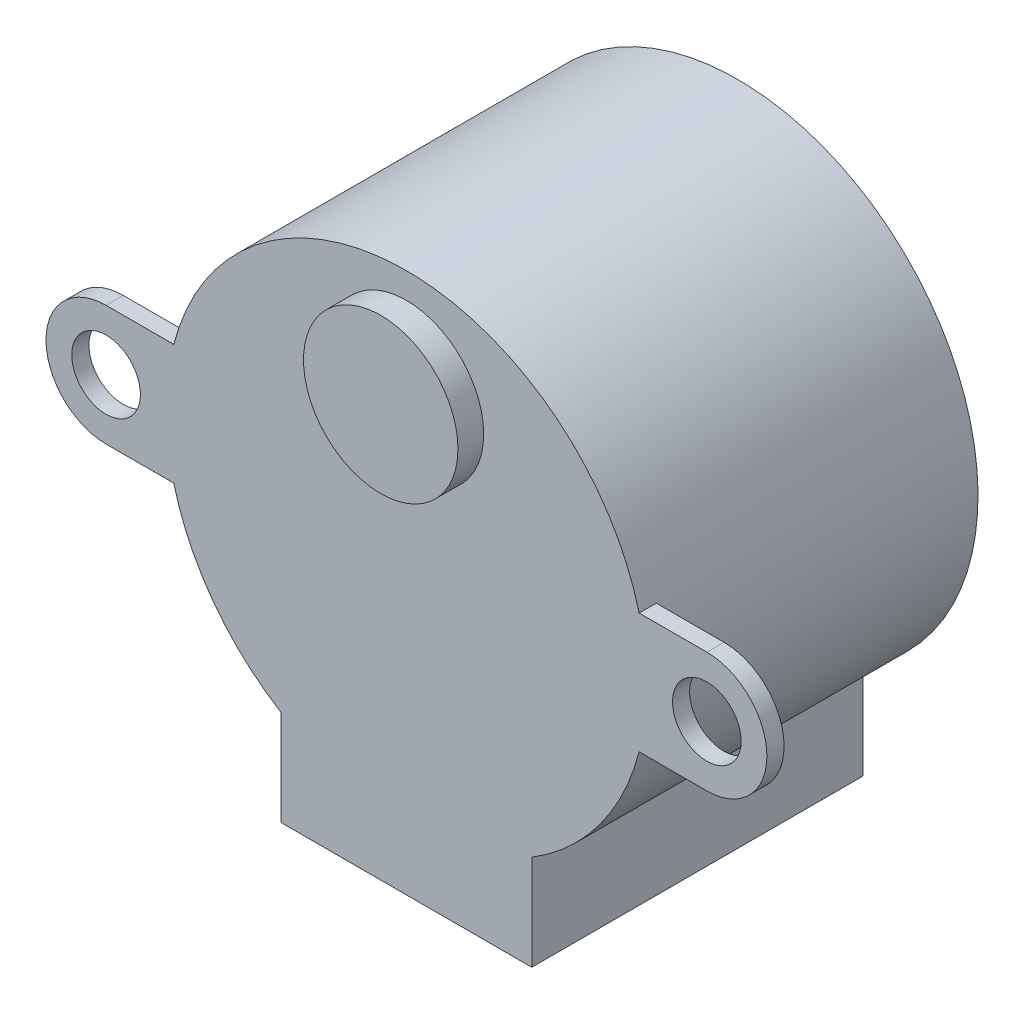
ISO-10303-21;
HEADER;
FILE_DESCRIPTION(('STEP AP214'),'2;1');
FILE_NAME('part.step','',(''),(''),'','','');
FILE_SCHEMA(('AUTOMOTIVE_DESIGN { 1 0 10303 214 1 1 1 1 }'));
ENDSEC;
DATA;
#1=APPLICATION_CONTEXT('core data for automotive mechanical design processes');
#2=APPLICATION_PROTOCOL_DEFINITION('international standard','automotive_design',2000,#1);
#3=PRODUCT_CONTEXT('',#1,'mechanical');
#4=PRODUCT('Part','Part','',(#3));
#5=PRODUCT_RELATED_PRODUCT_CATEGORY('part','',(#4));
#6=PRODUCT_DEFINITION_FORMATION('','',#4);
#7=PRODUCT_DEFINITION_CONTEXT('part definition',#1,'design');
#8=PRODUCT_DEFINITION('design','',#6,#7);
#9=PRODUCT_DEFINITION_SHAPE('','',#8);
#10=(LENGTH_UNIT() NAMED_UNIT(*) SI_UNIT(.MILLI.,.METRE.));
#11=(NAMED_UNIT(*) PLANE_ANGLE_UNIT() SI_UNIT($,.RADIAN.));
#12=(NAMED_UNIT(*) SI_UNIT($,.STERADIAN.) SOLID_ANGLE_UNIT());
#13=UNCERTAINTY_MEASURE_WITH_UNIT(LENGTH_MEASURE(1.E-05),#10,'distance_accuracy_value','');
#14=(GEOMETRIC_REPRESENTATION_CONTEXT(3) GLOBAL_UNCERTAINTY_ASSIGNED_CONTEXT((#13)) GLOBAL_UNIT_ASSIGNED_CONTEXT((#10,
#11,#12)) REPRESENTATION_CONTEXT('',''));
#15=CARTESIAN_POINT('',(0.,0.,0.));
#16=DIRECTION('',(0.,0.,1.));
#17=DIRECTION('',(1.,0.,0.));
#18=AXIS2_PLACEMENT_3D('',#15,#16,#17);
#19=CARTESIAN_POINT('',(-50.0234966452764,38.5025884499282,19.3));
#20=DIRECTION('',(0.,0.,-1.));
#21=DIRECTION('',(-1.,0.,0.));
#22=AXIS2_PLACEMENT_3D('',#19,#20,#21);
#23=CYLINDRICAL_SURFACE('',#22,14.);
#24=CARTESIAN_POINT('',(-50.0234966452764,38.5025884499282,0.));
#25=DIRECTION('',(0.,0.,1.));
#26=DIRECTION('',(1.,0.,0.));
#27=AXIS2_PLACEMENT_3D('',#24,#25,#26);
#28=CIRCLE('',#27,14.);
#29=CARTESIAN_POINT('',(-42.7234966452764,26.5564593697617,0.));
#30=VERTEX_POINT('',#29);
#31=CARTESIAN_POINT('',(-57.3234966452764,26.5564593697617,0.));
#32=VERTEX_POINT('',#31);
#33=EDGE_CURVE('E42',#30,#32,#28,.T.);
#34=ORIENTED_EDGE('',*,*,#33,.T.);
#35=DIRECTION('',(0.,0.,1.));
#36=VECTOR('',#35,1.);
#37=CARTESIAN_POINT('',(-57.3234966452764,26.5564593697617,18.3));
#38=LINE('',#37,#36);
#39=CARTESIAN_POINT('',(-57.3234966452764,26.5564593697617,19.3));
#40=VERTEX_POINT('',#39);
#41=EDGE_CURVE('E165',#32,#40,#38,.T.);
#42=ORIENTED_EDGE('',*,*,#41,.T.);
#43=CARTESIAN_POINT('',(-50.0234966452764,38.5025884499282,19.3));
#44=DIRECTION('',(0.,0.,1.));
#45=DIRECTION('',(1.,0.,0.));
#46=AXIS2_PLACEMENT_3D('',#43,#44,#45);
#47=CIRCLE('',#46,14.);
#48=CARTESIAN_POINT('',(-63.5789383570023,35.0025884499282,19.3));
#49=VERTEX_POINT('',#48);
#50=EDGE_CURVE('E11',#49,#40,#47,.T.);
#51=ORIENTED_EDGE('',*,*,#50,.F.);
#52=DIRECTION('',(0.,0.,1.));
#53=VECTOR('',#52,1.);
#54=CARTESIAN_POINT('',(-63.5789383570023,35.0025884499282,18.3));
#55=LINE('',#54,#53);
#56=CARTESIAN_POINT('',(-63.5789383570023,35.0025884499282,18.3));
#57=VERTEX_POINT('',#56);
#58=EDGE_CURVE('E231',#57,#49,#55,.T.);
#59=ORIENTED_EDGE('',*,*,#58,.F.);
#60=CARTESIAN_POINT('',(-50.0234966452764,38.5025884499282,18.3));
#61=DIRECTION('',(0.,0.,1.));
#62=DIRECTION('',(1.,0.,0.));
#63=AXIS2_PLACEMENT_3D('',#60,#61,#62);
#64=CIRCLE('',#63,14.);
#65=CARTESIAN_POINT('',(-63.5789383570023,42.0025884499282,18.3));
#66=VERTEX_POINT('',#65);
#67=EDGE_CURVE('E213',#66,#57,#64,.T.);
#68=ORIENTED_EDGE('',*,*,#67,.F.);
#69=DIRECTION('',(0.,0.,1.));
#70=VECTOR('',#69,1.);
#71=CARTESIAN_POINT('',(-63.5789383570023,42.0025884499282,18.3));
#72=LINE('',#71,#70);
#73=CARTESIAN_POINT('',(-63.5789383570023,42.0025884499282,19.3));
#74=VERTEX_POINT('',#73);
#75=EDGE_CURVE('E228',#66,#74,#72,.T.);
#76=ORIENTED_EDGE('',*,*,#75,.T.);
#77=CARTESIAN_POINT('',(-36.4680549335504,42.0025884499282,19.3));
#78=VERTEX_POINT('',#77);
#79=EDGE_CURVE('E48',#78,#74,#47,.T.);
#80=ORIENTED_EDGE('',*,*,#79,.F.);
#81=DIRECTION('',(0.,0.,1.));
#82=VECTOR('',#81,1.);
#83=CARTESIAN_POINT('',(-36.4680549335504,42.0025884499282,18.3));
#84=LINE('',#83,#82);
#85=CARTESIAN_POINT('',(-36.4680549335504,42.0025884499282,18.3));
#86=VERTEX_POINT('',#85);
#87=EDGE_CURVE('E63',#86,#78,#84,.T.);
#88=ORIENTED_EDGE('',*,*,#87,.F.);
#89=CARTESIAN_POINT('',(-50.0234966452764,38.5025884499282,18.3));
#90=DIRECTION('',(0.,0.,1.));
#91=DIRECTION('',(1.,0.,0.));
#92=AXIS2_PLACEMENT_3D('',#89,#90,#91);
#93=CIRCLE('',#92,14.);
#94=CARTESIAN_POINT('',(-36.4680549335504,35.0025884499282,18.3));
#95=VERTEX_POINT('',#94);
#96=EDGE_CURVE('E183',#95,#86,#93,.T.);
#97=ORIENTED_EDGE('',*,*,#96,.F.);
#98=DIRECTION('',(0.,0.,1.));
#99=VECTOR('',#98,1.);
#100=CARTESIAN_POINT('',(-36.4680549335504,35.0025884499282,18.3));
#101=LINE('',#100,#99);
#102=CARTESIAN_POINT('',(-36.4680549335504,35.0025884499282,19.3));
#103=VERTEX_POINT('',#102);
#104=EDGE_CURVE('E196',#95,#103,#101,.T.);
#105=ORIENTED_EDGE('',*,*,#104,.T.);
#106=CARTESIAN_POINT('',(-42.7234966452764,26.5564593697617,19.3));
#107=VERTEX_POINT('',#106);
#108=EDGE_CURVE('E47',#107,#103,#47,.T.);
#109=ORIENTED_EDGE('',*,*,#108,.F.);
#110=DIRECTION('',(0.,0.,1.));
#111=VECTOR('',#110,1.);
#112=CARTESIAN_POINT('',(-42.7234966452764,26.5564593697617,18.3));
#113=LINE('',#112,#111);
#114=EDGE_CURVE('E138',#30,#107,#113,.T.);
#115=ORIENTED_EDGE('',*,*,#114,.F.);
#116=EDGE_LOOP('',(#34,#42,#51,#59,#68,#76,#80,#88,#97,#105,#109,#115));
#117=FACE_BOUND('',#116,.T.);
#118=ADVANCED_FACE('F39',(#117),#23,.T.);
#119=CARTESIAN_POINT('',(-50.0234966452764,38.5025884499282,19.3));
#120=DIRECTION('',(0.,0.,1.));
#121=DIRECTION('',(1.,0.,0.));
#122=AXIS2_PLACEMENT_3D('',#119,#120,#121);
#123=PLANE('',#122);
#124=ORIENTED_EDGE('',*,*,#50,.T.);
#125=DIRECTION('',(0.,1.,0.));
#126=VECTOR('',#125,1.);
#127=CARTESIAN_POINT('',(-57.3234966452764,0.,19.3));
#128=LINE('',#127,#126);
#129=CARTESIAN_POINT('',(-57.3234966452764,21.0025884499282,19.3));
#130=VERTEX_POINT('',#129);
#131=EDGE_CURVE('E159',#130,#40,#128,.T.);
#132=ORIENTED_EDGE('',*,*,#131,.F.);
#133=DIRECTION('',(1.,0.,0.));
#134=VECTOR('',#133,1.);
#135=CARTESIAN_POINT('',(0.,21.0025884499282,19.3));
#136=LINE('',#135,#134);
#137=CARTESIAN_POINT('',(-42.7234966452764,21.0025884499282,19.3));
#138=VERTEX_POINT('',#137);
#139=EDGE_CURVE('E162',#130,#138,#136,.T.);
#140=ORIENTED_EDGE('',*,*,#139,.T.);
#141=DIRECTION('',(0.,1.,0.));
#142=VECTOR('',#141,1.);
#143=CARTESIAN_POINT('',(-42.7234966452764,0.,19.3));
#144=LINE('',#143,#142);
#145=EDGE_CURVE('E55',#138,#107,#144,.T.);
#146=ORIENTED_EDGE('',*,*,#145,.T.);
#147=ORIENTED_EDGE('',*,*,#108,.T.);
#148=DIRECTION('',(1.,0.,0.));
#149=VECTOR('',#148,1.);
#150=CARTESIAN_POINT('',(0.,35.0025884499282,19.3));
#151=LINE('',#150,#149);
#152=CARTESIAN_POINT('',(-32.5234966452764,35.0025884499282,19.3));
#153=VERTEX_POINT('',#152);
#154=EDGE_CURVE('E189',#103,#153,#151,.T.);
#155=ORIENTED_EDGE('',*,*,#154,.T.);
#156=CARTESIAN_POINT('',(-32.5234966452764,38.5025884499282,19.3));
#157=DIRECTION('',(0.,0.,1.));
#158=DIRECTION('',(1.,0.,0.));
#159=AXIS2_PLACEMENT_3D('',#156,#157,#158);
#160=CIRCLE('',#159,3.5);
#161=CARTESIAN_POINT('',(-32.5234966452764,42.0025884499282,19.3));
#162=VERTEX_POINT('',#161);
#163=EDGE_CURVE('E192',#153,#162,#160,.T.);
#164=ORIENTED_EDGE('',*,*,#163,.T.);
#165=DIRECTION('',(1.,0.,0.));
#166=VECTOR('',#165,1.);
#167=CARTESIAN_POINT('',(0.,42.0025884499282,19.3));
#168=LINE('',#167,#166);
#169=EDGE_CURVE('E175',#78,#162,#168,.T.);
#170=ORIENTED_EDGE('',*,*,#169,.F.);
#171=ORIENTED_EDGE('',*,*,#79,.T.);
#172=DIRECTION('',(1.,0.,0.));
#173=VECTOR('',#172,1.);
#174=CARTESIAN_POINT('',(0.,42.0025884499282,19.3));
#175=LINE('',#174,#173);
#176=CARTESIAN_POINT('',(-67.5234966452764,42.0025884499282,19.3));
#177=VERTEX_POINT('',#176);
#178=EDGE_CURVE('E199',#177,#74,#175,.T.);
#179=ORIENTED_EDGE('',*,*,#178,.F.);
#180=CARTESIAN_POINT('',(-67.5234966452764,38.5025884499282,19.3));
#181=DIRECTION('',(0.,0.,1.));
#182=DIRECTION('',(1.,0.,0.));
#183=AXIS2_PLACEMENT_3D('',#180,#181,#182);
#184=CIRCLE('',#183,3.5);
#185=CARTESIAN_POINT('',(-67.5234966452764,35.0025884499282,19.3));
#186=VERTEX_POINT('',#185);
#187=EDGE_CURVE('E221',#177,#186,#184,.T.);
#188=ORIENTED_EDGE('',*,*,#187,.T.);
#189=DIRECTION('',(1.,0.,0.));
#190=VECTOR('',#189,1.);
#191=CARTESIAN_POINT('',(0.,35.0025884499282,19.3));
#192=LINE('',#191,#190);
#193=EDGE_CURVE('E224',#186,#49,#192,.T.);
#194=ORIENTED_EDGE('',*,*,#193,.T.);
#195=EDGE_LOOP('',(#124,#132,#140,#146,#147,#155,#164,#170,#171,#179,#188,#194));
#196=FACE_BOUND('',#195,.T.);
#197=CARTESIAN_POINT('',(-50.0234966452764,46.5025884499282,19.3));
#198=DIRECTION('',(0.,0.,1.));
#199=DIRECTION('',(1.,0.,0.));
#200=AXIS2_PLACEMENT_3D('',#197,#198,#199);
#201=CIRCLE('',#200,4.5);
#202=CARTESIAN_POINT('',(-45.5234966452764,46.5025884499282,19.3));
#203=VERTEX_POINT('',#202);
#204=EDGE_CURVE('E151',#203,#203,#201,.T.);
#205=ORIENTED_EDGE('',*,*,#204,.F.);
#206=EDGE_LOOP('',(#205));
#207=FACE_BOUND('',#206,.T.);
#208=CARTESIAN_POINT('',(-67.5234966452764,38.5025884499282,19.3));
#209=DIRECTION('',(0.,0.,1.));
#210=DIRECTION('',(1.,0.,0.));
#211=AXIS2_PLACEMENT_3D('',#208,#209,#210);
#212=CIRCLE('',#211,2.00000000000001);
#213=CARTESIAN_POINT('',(-65.5234966452764,38.5025884499282,19.3));
#214=VERTEX_POINT('',#213);
#215=EDGE_CURVE('E207',#214,#214,#212,.F.);
#216=ORIENTED_EDGE('',*,*,#215,.T.);
#217=EDGE_LOOP('',(#216));
#218=FACE_BOUND('',#217,.T.);
#219=CARTESIAN_POINT('',(-32.5234966452764,38.5025884499282,19.3));
#220=DIRECTION('',(0.,0.,1.));
#221=DIRECTION('',(1.,0.,0.));
#222=AXIS2_PLACEMENT_3D('',#219,#220,#221);
#223=CIRCLE('',#222,2.);
#224=CARTESIAN_POINT('',(-30.5234966452764,38.5025884499282,19.3));
#225=VERTEX_POINT('',#224);
#226=EDGE_CURVE('E168',#225,#225,#223,.T.);
#227=ORIENTED_EDGE('',*,*,#226,.F.);
#228=EDGE_LOOP('',(#227));
#229=FACE_BOUND('',#228,.T.);
#230=ADVANCED_FACE('F244',(#196,#207,#218,#229),#123,.T.);
#231=CARTESIAN_POINT('',(-50.0234966452764,38.5025884499282,0.));
#232=DIRECTION('',(0.,0.,1.));
#233=DIRECTION('',(1.,0.,0.));
#234=AXIS2_PLACEMENT_3D('',#231,#232,#233);
#235=PLANE('',#234);
#236=ORIENTED_EDGE('',*,*,#33,.F.);
#237=DIRECTION('',(0.,-1.,0.));
#238=VECTOR('',#237,1.);
#239=CARTESIAN_POINT('',(-42.7234966452764,21.0025884499282,0.));
#240=LINE('',#239,#238);
#241=CARTESIAN_POINT('',(-42.7234966452764,21.0025884499282,0.));
#242=VERTEX_POINT('',#241);
#243=EDGE_CURVE('E133',#30,#242,#240,.T.);
#244=ORIENTED_EDGE('',*,*,#243,.T.);
#245=DIRECTION('',(-1.,0.,0.));
#246=VECTOR('',#245,1.);
#247=CARTESIAN_POINT('',(-57.3234966452764,21.0025884499282,0.));
#248=LINE('',#247,#246);
#249=CARTESIAN_POINT('',(-57.3234966452764,21.0025884499282,0.));
#250=VERTEX_POINT('',#249);
#251=EDGE_CURVE('E145',#242,#250,#248,.T.);
#252=ORIENTED_EDGE('',*,*,#251,.T.);
#253=DIRECTION('',(0.,1.,0.));
#254=VECTOR('',#253,1.);
#255=CARTESIAN_POINT('',(-57.3234966452764,21.0025884499282,0.));
#256=LINE('',#255,#254);
#257=EDGE_CURVE('E148',#250,#32,#256,.T.);
#258=ORIENTED_EDGE('',*,*,#257,.T.);
#259=EDGE_LOOP('',(#236,#244,#252,#258));
#260=FACE_BOUND('',#259,.T.);
#261=ADVANCED_FACE('F143',(#260),#235,.F.);
#262=CARTESIAN_POINT('',(0.,42.0025884499282,18.3));
#263=DIRECTION('',(0.,-1.,0.));
#264=DIRECTION('',(0.,0.,-1.));
#265=AXIS2_PLACEMENT_3D('',#262,#263,#264);
#266=PLANE('',#265);
#267=ORIENTED_EDGE('',*,*,#178,.T.);
#268=ORIENTED_EDGE('',*,*,#75,.F.);
#269=DIRECTION('',(1.,0.,0.));
#270=VECTOR('',#269,1.);
#271=CARTESIAN_POINT('',(0.,42.0025884499282,18.3));
#272=LINE('',#271,#270);
#273=CARTESIAN_POINT('',(-67.5234966452764,42.0025884499282,18.3));
#274=VERTEX_POINT('',#273);
#275=EDGE_CURVE('E204',#274,#66,#272,.T.);
#276=ORIENTED_EDGE('',*,*,#275,.F.);
#277=DIRECTION('',(0.,0.,1.));
#278=VECTOR('',#277,1.);
#279=CARTESIAN_POINT('',(-67.5234966452764,42.0025884499282,18.3));
#280=LINE('',#279,#278);
#281=EDGE_CURVE('E218',#274,#177,#280,.T.);
#282=ORIENTED_EDGE('',*,*,#281,.T.);
#283=EDGE_LOOP('',(#267,#268,#276,#282));
#284=FACE_BOUND('',#283,.T.);
#285=ADVANCED_FACE('F239',(#284),#266,.F.);
#286=CARTESIAN_POINT('',(0.,35.0025884499282,18.3));
#287=DIRECTION('',(0.,-1.,0.));
#288=DIRECTION('',(0.,0.,-1.));
#289=AXIS2_PLACEMENT_3D('',#286,#287,#288);
#290=PLANE('',#289);
#291=ORIENTED_EDGE('',*,*,#193,.F.);
#292=DIRECTION('',(0.,0.,1.));
#293=VECTOR('',#292,1.);
#294=CARTESIAN_POINT('',(-67.5234966452764,35.0025884499282,18.3));
#295=LINE('',#294,#293);
#296=CARTESIAN_POINT('',(-67.5234966452764,35.0025884499282,18.3));
#297=VERTEX_POINT('',#296);
#298=EDGE_CURVE('E234',#297,#186,#295,.T.);
#299=ORIENTED_EDGE('',*,*,#298,.F.);
#300=DIRECTION('',(1.,0.,0.));
#301=VECTOR('',#300,1.);
#302=CARTESIAN_POINT('',(0.,35.0025884499282,18.3));
#303=LINE('',#302,#301);
#304=EDGE_CURVE('E210',#297,#57,#303,.T.);
#305=ORIENTED_EDGE('',*,*,#304,.T.);
#306=ORIENTED_EDGE('',*,*,#58,.T.);
#307=EDGE_LOOP('',(#291,#299,#305,#306));
#308=FACE_BOUND('',#307,.T.);
#309=ADVANCED_FACE('F251',(#308),#290,.T.);
#310=CARTESIAN_POINT('',(-67.5234966452764,38.5025884499282,18.3));
#311=DIRECTION('',(0.,0.,1.));
#312=DIRECTION('',(1.,0.,0.));
#313=AXIS2_PLACEMENT_3D('',#310,#311,#312);
#314=CYLINDRICAL_SURFACE('',#313,3.5);
#315=ORIENTED_EDGE('',*,*,#187,.F.);
#316=ORIENTED_EDGE('',*,*,#281,.F.);
#317=CARTESIAN_POINT('',(-67.5234966452764,38.5025884499282,18.3));
#318=DIRECTION('',(0.,0.,1.));
#319=DIRECTION('',(1.,0.,0.));
#320=AXIS2_PLACEMENT_3D('',#317,#318,#319);
#321=CIRCLE('',#320,3.5);
#322=EDGE_CURVE('E206',#274,#297,#321,.T.);
#323=ORIENTED_EDGE('',*,*,#322,.T.);
#324=ORIENTED_EDGE('',*,*,#298,.T.);
#325=EDGE_LOOP('',(#315,#316,#323,#324));
#326=FACE_BOUND('',#325,.T.);
#327=ADVANCED_FACE('F247',(#326),#314,.T.);
#328=CARTESIAN_POINT('',(-67.5234966452764,38.5025884499282,18.3));
#329=DIRECTION('',(0.,0.,1.));
#330=DIRECTION('',(1.,0.,0.));
#331=AXIS2_PLACEMENT_3D('',#328,#329,#330);
#332=CYLINDRICAL_SURFACE('',#331,2.00000000000001);
#333=CARTESIAN_POINT('',(-67.5234966452764,38.5025884499282,18.3));
#334=DIRECTION('',(0.,0.,1.));
#335=DIRECTION('',(1.,0.,0.));
#336=AXIS2_PLACEMENT_3D('',#333,#334,#335);
#337=CIRCLE('',#336,2.00000000000001);
#338=CARTESIAN_POINT('',(-65.5234966452764,38.5025884499282,18.3));
#339=VERTEX_POINT('',#338);
#340=EDGE_CURVE('E215',#339,#339,#337,.F.);
#341=ORIENTED_EDGE('',*,*,#340,.T.);
#342=EDGE_LOOP('',(#341));
#343=FACE_BOUND('',#342,.T.);
#344=ORIENTED_EDGE('',*,*,#215,.F.);
#345=EDGE_LOOP('',(#344));
#346=FACE_BOUND('',#345,.T.);
#347=ADVANCED_FACE('F286',(#343,#346),#332,.F.);
#348=CARTESIAN_POINT('',(0.,0.,18.3));
#349=DIRECTION('',(0.,0.,1.));
#350=DIRECTION('',(1.,0.,0.));
#351=AXIS2_PLACEMENT_3D('',#348,#349,#350);
#352=PLANE('',#351);
#353=ORIENTED_EDGE('',*,*,#275,.T.);
#354=ORIENTED_EDGE('',*,*,#67,.T.);
#355=ORIENTED_EDGE('',*,*,#304,.F.);
#356=ORIENTED_EDGE('',*,*,#322,.F.);
#357=EDGE_LOOP('',(#353,#354,#355,#356));
#358=FACE_BOUND('',#357,.T.);
#359=ORIENTED_EDGE('',*,*,#340,.F.);
#360=EDGE_LOOP('',(#359));
#361=FACE_BOUND('',#360,.T.);
#362=ADVANCED_FACE('F291',(#358,#361),#352,.F.);
#363=CARTESIAN_POINT('',(0.,35.0025884499282,18.3));
#364=DIRECTION('',(0.,-1.,0.));
#365=DIRECTION('',(0.,0.,-1.));
#366=AXIS2_PLACEMENT_3D('',#363,#364,#365);
#367=PLANE('',#366);
#368=ORIENTED_EDGE('',*,*,#154,.F.);
#369=ORIENTED_EDGE('',*,*,#104,.F.);
#370=DIRECTION('',(1.,0.,0.));
#371=VECTOR('',#370,1.);
#372=CARTESIAN_POINT('',(0.,35.0025884499282,18.3));
#373=LINE('',#372,#371);
#374=CARTESIAN_POINT('',(-32.5234966452764,35.0025884499282,18.3));
#375=VERTEX_POINT('',#374);
#376=EDGE_CURVE('E174',#95,#375,#373,.T.);
#377=ORIENTED_EDGE('',*,*,#376,.T.);
#378=DIRECTION('',(0.,0.,1.));
#379=VECTOR('',#378,1.);
#380=CARTESIAN_POINT('',(-32.5234966452764,35.0025884499282,18.3));
#381=LINE('',#380,#379);
#382=EDGE_CURVE('E186',#375,#153,#381,.T.);
#383=ORIENTED_EDGE('',*,*,#382,.T.);
#384=EDGE_LOOP('',(#368,#369,#377,#383));
#385=FACE_BOUND('',#384,.T.);
#386=ADVANCED_FACE('F295',(#385),#367,.T.);
#387=CARTESIAN_POINT('',(0.,42.0025884499282,18.3));
#388=DIRECTION('',(0.,-1.,0.));
#389=DIRECTION('',(0.,0.,-1.));
#390=AXIS2_PLACEMENT_3D('',#387,#388,#389);
#391=PLANE('',#390);
#392=ORIENTED_EDGE('',*,*,#169,.T.);
#393=DIRECTION('',(0.,0.,1.));
#394=VECTOR('',#393,1.);
#395=CARTESIAN_POINT('',(-32.5234966452764,42.0025884499282,18.3));
#396=LINE('',#395,#394);
#397=CARTESIAN_POINT('',(-32.5234966452764,42.0025884499282,18.3));
#398=VERTEX_POINT('',#397);
#399=EDGE_CURVE('E201',#398,#162,#396,.T.);
#400=ORIENTED_EDGE('',*,*,#399,.F.);
#401=DIRECTION('',(1.,0.,0.));
#402=VECTOR('',#401,1.);
#403=CARTESIAN_POINT('',(0.,42.0025884499282,18.3));
#404=LINE('',#403,#402);
#405=EDGE_CURVE('E181',#86,#398,#404,.T.);
#406=ORIENTED_EDGE('',*,*,#405,.F.);
#407=ORIENTED_EDGE('',*,*,#87,.T.);
#408=EDGE_LOOP('',(#392,#400,#406,#407));
#409=FACE_BOUND('',#408,.T.);
#410=ADVANCED_FACE('F300',(#409),#391,.F.);
#411=CARTESIAN_POINT('',(-32.5234966452764,38.5025884499282,18.3));
#412=DIRECTION('',(0.,0.,1.));
#413=DIRECTION('',(1.,0.,0.));
#414=AXIS2_PLACEMENT_3D('',#411,#412,#413);
#415=CYLINDRICAL_SURFACE('',#414,2.);
#416=CARTESIAN_POINT('',(-32.5234966452764,38.5025884499282,18.3));
#417=DIRECTION('',(0.,0.,1.));
#418=DIRECTION('',(1.,0.,0.));
#419=AXIS2_PLACEMENT_3D('',#416,#417,#418);
#420=CIRCLE('',#419,2.);
#421=CARTESIAN_POINT('',(-30.5234966452764,38.5025884499282,18.3));
#422=VERTEX_POINT('',#421);
#423=EDGE_CURVE('E171',#422,#422,#420,.T.);
#424=ORIENTED_EDGE('',*,*,#423,.F.);
#425=EDGE_LOOP('',(#424));
#426=FACE_BOUND('',#425,.T.);
#427=ORIENTED_EDGE('',*,*,#226,.T.);
#428=EDGE_LOOP('',(#427));
#429=FACE_BOUND('',#428,.T.);
#430=ADVANCED_FACE('F297',(#426,#429),#415,.F.);
#431=CARTESIAN_POINT('',(-32.5234966452764,38.5025884499282,18.3));
#432=DIRECTION('',(0.,0.,1.));
#433=DIRECTION('',(1.,0.,0.));
#434=AXIS2_PLACEMENT_3D('',#431,#432,#433);
#435=CYLINDRICAL_SURFACE('',#434,3.5);
#436=ORIENTED_EDGE('',*,*,#163,.F.);
#437=ORIENTED_EDGE('',*,*,#382,.F.);
#438=CARTESIAN_POINT('',(-32.5234966452764,38.5025884499282,18.3));
#439=DIRECTION('',(0.,0.,1.));
#440=DIRECTION('',(1.,0.,0.));
#441=AXIS2_PLACEMENT_3D('',#438,#439,#440);
#442=CIRCLE('',#441,3.5);
#443=EDGE_CURVE('E178',#375,#398,#442,.T.);
#444=ORIENTED_EDGE('',*,*,#443,.T.);
#445=ORIENTED_EDGE('',*,*,#399,.T.);
#446=EDGE_LOOP('',(#436,#437,#444,#445));
#447=FACE_BOUND('',#446,.T.);
#448=ADVANCED_FACE('F268',(#447),#435,.T.);
#449=CARTESIAN_POINT('',(0.,0.,18.3));
#450=DIRECTION('',(0.,0.,1.));
#451=DIRECTION('',(1.,0.,0.));
#452=AXIS2_PLACEMENT_3D('',#449,#450,#451);
#453=PLANE('',#452);
#454=ORIENTED_EDGE('',*,*,#423,.T.);
#455=EDGE_LOOP('',(#454));
#456=FACE_BOUND('',#455,.T.);
#457=ORIENTED_EDGE('',*,*,#376,.F.);
#458=ORIENTED_EDGE('',*,*,#96,.T.);
#459=ORIENTED_EDGE('',*,*,#405,.T.);
#460=ORIENTED_EDGE('',*,*,#443,.F.);
#461=EDGE_LOOP('',(#457,#458,#459,#460));
#462=FACE_BOUND('',#461,.T.);
#463=ADVANCED_FACE('F260',(#456,#462),#453,.F.);
#464=CARTESIAN_POINT('',(-57.3234966452764,0.,18.3));
#465=DIRECTION('',(1.,0.,0.));
#466=DIRECTION('',(0.,0.,-1.));
#467=AXIS2_PLACEMENT_3D('',#464,#465,#466);
#468=PLANE('',#467);
#469=ORIENTED_EDGE('',*,*,#131,.T.);
#470=ORIENTED_EDGE('',*,*,#41,.F.);
#471=ORIENTED_EDGE('',*,*,#257,.F.);
#472=DIRECTION('',(0.,0.,1.));
#473=VECTOR('',#472,1.);
#474=CARTESIAN_POINT('',(-57.3234966452764,21.0025884499282,18.3));
#475=LINE('',#474,#473);
#476=EDGE_CURVE('E139',#250,#130,#475,.T.);
#477=ORIENTED_EDGE('',*,*,#476,.T.);
#478=EDGE_LOOP('',(#469,#470,#471,#477));
#479=FACE_BOUND('',#478,.T.);
#480=ADVANCED_FACE('F258',(#479),#468,.F.);
#481=CARTESIAN_POINT('',(-42.7234966452764,0.,18.3));
#482=DIRECTION('',(1.,0.,0.));
#483=DIRECTION('',(0.,0.,-1.));
#484=AXIS2_PLACEMENT_3D('',#481,#482,#483);
#485=PLANE('',#484);
#486=ORIENTED_EDGE('',*,*,#145,.F.);
#487=DIRECTION('',(0.,0.,1.));
#488=VECTOR('',#487,1.);
#489=CARTESIAN_POINT('',(-42.7234966452764,21.0025884499282,18.3));
#490=LINE('',#489,#488);
#491=EDGE_CURVE('E130',#242,#138,#490,.T.);
#492=ORIENTED_EDGE('',*,*,#491,.F.);
#493=ORIENTED_EDGE('',*,*,#243,.F.);
#494=ORIENTED_EDGE('',*,*,#114,.T.);
#495=EDGE_LOOP('',(#486,#492,#493,#494));
#496=FACE_BOUND('',#495,.T.);
#497=ADVANCED_FACE('F132',(#496),#485,.T.);
#498=CARTESIAN_POINT('',(0.,21.0025884499282,18.3));
#499=DIRECTION('',(0.,-1.,0.));
#500=DIRECTION('',(0.,0.,-1.));
#501=AXIS2_PLACEMENT_3D('',#498,#499,#500);
#502=PLANE('',#501);
#503=ORIENTED_EDGE('',*,*,#139,.F.);
#504=ORIENTED_EDGE('',*,*,#476,.F.);
#505=ORIENTED_EDGE('',*,*,#251,.F.);
#506=ORIENTED_EDGE('',*,*,#491,.T.);
#507=EDGE_LOOP('',(#503,#504,#505,#506));
#508=FACE_BOUND('',#507,.T.);
#509=ADVANCED_FACE('F150',(#508),#502,.T.);
#510=CARTESIAN_POINT('',(-50.0234966452764,46.5025884499282,20.8));
#511=DIRECTION('',(0.,0.,-1.));
#512=DIRECTION('',(-1.,0.,0.));
#513=AXIS2_PLACEMENT_3D('',#510,#511,#512);
#514=CYLINDRICAL_SURFACE('',#513,4.5);
#515=CARTESIAN_POINT('',(-50.0234966452764,46.5025884499282,20.8));
#516=DIRECTION('',(0.,0.,1.));
#517=DIRECTION('',(1.,0.,0.));
#518=AXIS2_PLACEMENT_3D('',#515,#516,#517);
#519=CIRCLE('',#518,4.5);
#520=CARTESIAN_POINT('',(-45.5234966452764,46.5025884499282,20.8));
#521=VERTEX_POINT('',#520);
#522=EDGE_CURVE('E154',#521,#521,#519,.T.);
#523=ORIENTED_EDGE('',*,*,#522,.F.);
#524=EDGE_LOOP('',(#523));
#525=FACE_BOUND('',#524,.T.);
#526=ORIENTED_EDGE('',*,*,#204,.T.);
#527=EDGE_LOOP('',(#526));
#528=FACE_BOUND('',#527,.T.);
#529=ADVANCED_FACE('F345',(#525,#528),#514,.T.);
#530=CARTESIAN_POINT('',(-50.0234966452764,46.5025884499282,20.8));
#531=DIRECTION('',(0.,0.,1.));
#532=DIRECTION('',(1.,0.,0.));
#533=AXIS2_PLACEMENT_3D('',#530,#531,#532);
#534=PLANE('',#533);
#535=ORIENTED_EDGE('',*,*,#522,.T.);
#536=EDGE_LOOP('',(#535));
#537=FACE_BOUND('',#536,.T.);
#538=ADVANCED_FACE('F348',(#537),#534,.T.);
#539=CLOSED_SHELL('',(#118,#230,#261,#285,#309,#327,#347,#362,#386,#410,#430,#448,#463,#480,
#497,#509,#529,#538));
#540=MANIFOLD_SOLID_BREP('B2',#539);
#541=ADVANCED_BREP_SHAPE_REPRESENTATION('',(#18,#540),#14);
#542=SHAPE_DEFINITION_REPRESENTATION(#9,#541);
ENDSEC;
END-ISO-10303-21;
